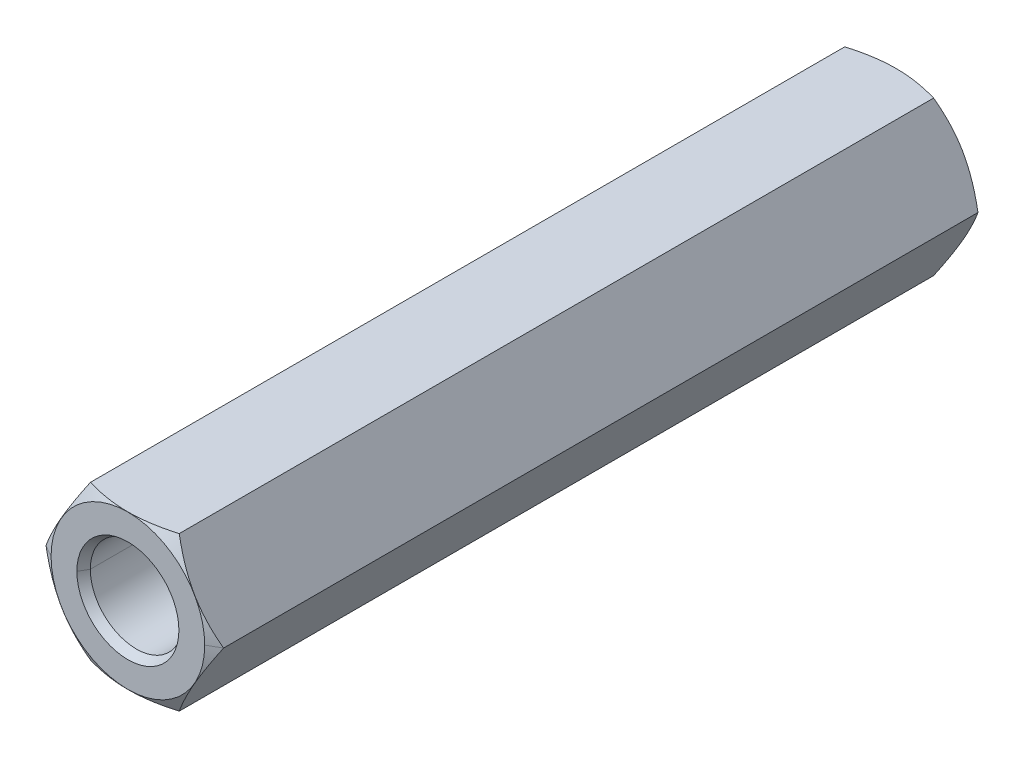
ISO-10303-21;
HEADER;
FILE_DESCRIPTION(('STEP AP214'),'2;1');
FILE_NAME('part.step','',(''),(''),'','','');
FILE_SCHEMA(('AUTOMOTIVE_DESIGN { 1 0 10303 214 1 1 1 1 }'));
ENDSEC;
DATA;
#1=APPLICATION_CONTEXT('core data for automotive mechanical design processes');
#2=APPLICATION_PROTOCOL_DEFINITION('international standard','automotive_design',2000,#1);
#3=PRODUCT_CONTEXT('',#1,'mechanical');
#4=PRODUCT('Part','Part','',(#3));
#5=PRODUCT_RELATED_PRODUCT_CATEGORY('part','',(#4));
#6=PRODUCT_DEFINITION_FORMATION('','',#4);
#7=PRODUCT_DEFINITION_CONTEXT('part definition',#1,'design');
#8=PRODUCT_DEFINITION('design','',#6,#7);
#9=PRODUCT_DEFINITION_SHAPE('','',#8);
#10=(LENGTH_UNIT() NAMED_UNIT(*) SI_UNIT(.MILLI.,.METRE.));
#11=(NAMED_UNIT(*) PLANE_ANGLE_UNIT() SI_UNIT($,.RADIAN.));
#12=(NAMED_UNIT(*) SI_UNIT($,.STERADIAN.) SOLID_ANGLE_UNIT());
#13=UNCERTAINTY_MEASURE_WITH_UNIT(LENGTH_MEASURE(1.E-05),#10,'distance_accuracy_value','');
#14=(GEOMETRIC_REPRESENTATION_CONTEXT(3) GLOBAL_UNCERTAINTY_ASSIGNED_CONTEXT((#13)) GLOBAL_UNIT_ASSIGNED_CONTEXT((#10,
#11,#12)) REPRESENTATION_CONTEXT('',''));
#15=CARTESIAN_POINT('',(0.,0.,0.));
#16=DIRECTION('',(0.,0.,1.));
#17=DIRECTION('',(1.,0.,0.));
#18=AXIS2_PLACEMENT_3D('',#15,#16,#17);
#19=CARTESIAN_POINT('',(116.318744279938,82.8420432923505,150.447608312383));
#20=DIRECTION('',(0.,0.,-1.));
#21=DIRECTION('',(1.,0.,0.));
#22=AXIS2_PLACEMENT_3D('',#19,#20,#21);
#23=CONICAL_SURFACE('',#22,1.73205080757048,1.047197551197);
#24=DIRECTION('',(0.86602540378464,0.,-0.499999999999652));
#25=VECTOR('',#24,1.);
#26=CARTESIAN_POINT('',(118.050795087508,82.8420432923505,150.447608312383));
#27=LINE('',#26,#25);
#28=CARTESIAN_POINT('',(116.318744279938,82.8420432923505,151.447608312383));
#29=VERTEX_POINT('',#28);
#30=CARTESIAN_POINT('',(117.818744279938,82.8420432923505,150.581582908599));
#31=VERTEX_POINT('',#30);
#32=EDGE_CURVE('E67',#29,#31,#27,.T.);
#33=ORIENTED_EDGE('',*,*,#32,.F.);
#34=DIRECTION('',(-0.86602540378464,0.,-0.499999999999652));
#35=VECTOR('',#34,1.);
#36=CARTESIAN_POINT('',(114.586693472367,82.8420432923505,150.447608312383));
#37=LINE('',#36,#35);
#38=CARTESIAN_POINT('',(114.818744279938,82.8420432923505,150.581582908599));
#39=VERTEX_POINT('',#38);
#40=EDGE_CURVE('E11',#29,#39,#37,.T.);
#41=ORIENTED_EDGE('',*,*,#40,.T.);
#42=CARTESIAN_POINT('',(116.318744279938,82.8420432923505,150.581582908599));
#43=DIRECTION('',(0.,0.,1.));
#44=DIRECTION('',(1.,0.,0.));
#45=AXIS2_PLACEMENT_3D('',#42,#43,#44);
#46=CIRCLE('',#45,1.5);
#47=EDGE_CURVE('E55',#31,#39,#46,.T.);
#48=ORIENTED_EDGE('',*,*,#47,.F.);
#49=EDGE_LOOP('',(#33,#41,#48));
#50=FACE_BOUND('',#49,.T.);
#51=ADVANCED_FACE('F44',(#50),#23,.F.);
#52=CARTESIAN_POINT('',(116.318744279938,82.8420432923505,150.581582908599));
#53=DIRECTION('',(0.,0.,-1.));
#54=DIRECTION('',(1.,0.,0.));
#55=AXIS2_PLACEMENT_3D('',#52,#53,#54);
#56=CYLINDRICAL_SURFACE('',#55,1.5);
#57=ORIENTED_EDGE('',*,*,#47,.T.);
#58=DIRECTION('',(0.,0.,-1.));
#59=VECTOR('',#58,1.);
#60=CARTESIAN_POINT('',(114.818744279938,82.8420432923505,150.581582908599));
#61=LINE('',#60,#59);
#62=CARTESIAN_POINT('',(114.818744279938,82.8420432923505,140.858711037809));
#63=VERTEX_POINT('',#62);
#64=EDGE_CURVE('E267',#39,#63,#61,.T.);
#65=ORIENTED_EDGE('',*,*,#64,.T.);
#66=CARTESIAN_POINT('',(116.318744279938,82.8420432923505,140.858711037809));
#67=DIRECTION('',(0.,0.,1.));
#68=DIRECTION('',(1.,0.,0.));
#69=AXIS2_PLACEMENT_3D('',#66,#67,#68);
#70=CIRCLE('',#69,1.5);
#71=CARTESIAN_POINT('',(117.818744279938,82.8420432923505,140.858711037809));
#72=VERTEX_POINT('',#71);
#73=EDGE_CURVE('E263',#72,#63,#70,.T.);
#74=ORIENTED_EDGE('',*,*,#73,.F.);
#75=DIRECTION('',(0.,0.,-1.));
#76=VECTOR('',#75,1.);
#77=CARTESIAN_POINT('',(117.818744279938,82.8420432923505,150.581582908599));
#78=LINE('',#77,#76);
#79=EDGE_CURVE('E240',#31,#72,#78,.T.);
#80=ORIENTED_EDGE('',*,*,#79,.F.);
#81=EDGE_LOOP('',(#57,#65,#74,#80));
#82=FACE_BOUND('',#81,.T.);
#83=ADVANCED_FACE('F488',(#82),#56,.F.);
#84=CARTESIAN_POINT('',(116.318744279938,82.8420432923505,140.858711037809));
#85=DIRECTION('',(0.,0.,-1.));
#86=DIRECTION('',(1.,0.,0.));
#87=AXIS2_PLACEMENT_3D('',#84,#85,#86);
#88=CONICAL_SURFACE('',#87,1.5,0.5235987756);
#89=ORIENTED_EDGE('',*,*,#73,.T.);
#90=DIRECTION('',(-0.500000000001473,0.,-0.866025403783588));
#91=VECTOR('',#90,1.);
#92=CARTESIAN_POINT('',(114.818744279938,82.8420432923505,140.858711037809));
#93=LINE('',#92,#91);
#94=CARTESIAN_POINT('',(114.658744279938,82.8420432923505,140.581582908599));
#95=VERTEX_POINT('',#94);
#96=EDGE_CURVE('E268',#63,#95,#93,.T.);
#97=ORIENTED_EDGE('',*,*,#96,.T.);
#98=CARTESIAN_POINT('',(116.318744279938,82.8420432923505,140.581582908599));
#99=DIRECTION('',(0.,0.,1.));
#100=DIRECTION('',(1.,0.,0.));
#101=AXIS2_PLACEMENT_3D('',#98,#99,#100);
#102=CIRCLE('',#101,1.66);
#103=CARTESIAN_POINT('',(117.978744279938,82.8420432923505,140.581582908599));
#104=VERTEX_POINT('',#103);
#105=EDGE_CURVE('E248',#104,#95,#102,.T.);
#106=ORIENTED_EDGE('',*,*,#105,.F.);
#107=DIRECTION('',(0.500000000001473,0.,-0.866025403783588));
#108=VECTOR('',#107,1.);
#109=CARTESIAN_POINT('',(117.818744279938,82.8420432923505,140.858711037809));
#110=LINE('',#109,#108);
#111=EDGE_CURVE('E250',#72,#104,#110,.T.);
#112=ORIENTED_EDGE('',*,*,#111,.F.);
#113=EDGE_LOOP('',(#89,#97,#106,#112));
#114=FACE_BOUND('',#113,.T.);
#115=ADVANCED_FACE('F505',(#114),#88,.F.);
#116=CARTESIAN_POINT('',(116.318744279938,82.8420432923505,140.581582908599));
#117=DIRECTION('',(0.,0.,1.));
#118=DIRECTION('',(1.,0.,0.));
#119=AXIS2_PLACEMENT_3D('',#116,#117,#118);
#120=CONICAL_SURFACE('',#119,2.5,1.047197551197);
#121=CARTESIAN_POINT('',(116.318744279938,82.8420432923505,140.581582908599));
#122=DIRECTION('',(0.,0.,1.));
#123=DIRECTION('',(1.,0.,0.));
#124=AXIS2_PLACEMENT_3D('',#121,#122,#123);
#125=CIRCLE('',#124,2.5);
#126=CARTESIAN_POINT('',(118.818744279938,82.8420432923505,140.581582908599));
#127=VERTEX_POINT('',#126);
#128=CARTESIAN_POINT('',(113.818744279938,82.8420432923505,140.581582908599));
#129=VERTEX_POINT('',#128);
#130=EDGE_CURVE('E289',#127,#129,#125,.T.);
#131=ORIENTED_EDGE('',*,*,#130,.T.);
#132=DIRECTION('',(-0.86602540378464,0.,0.499999999999652));
#133=VECTOR('',#132,1.);
#134=CARTESIAN_POINT('',(113.818744279938,82.8420432923505,140.581582908599));
#135=LINE('',#134,#133);
#136=CARTESIAN_POINT('',(113.428744279938,82.8420432923504,140.806749513583));
#137=VERTEX_POINT('',#136);
#138=EDGE_CURVE('E293',#129,#137,#135,.T.);
#139=ORIENTED_EDGE('',*,*,#138,.T.);
#140=CARTESIAN_POINT('',(114.873744279938,85.3448567092875,140.806749513583));
#141=CARTESIAN_POINT('',(114.151244279938,84.0934500008193,140.389613944093));
#142=CARTESIAN_POINT('',(113.428744279938,82.8420432923504,140.806749513583));
#143=(BOUNDED_CURVE() B_SPLINE_CURVE(2,(#140,#141,#142),.UNSPECIFIED.,.F.,
.F.) B_SPLINE_CURVE_WITH_KNOTS((3,3),(0.,1.),
.UNSPECIFIED.) CURVE() GEOMETRIC_REPRESENTATION_ITEM() RATIONAL_B_SPLINE_CURVE((1.,
1.15470053837935,1.)) REPRESENTATION_ITEM(''));
#144=CARTESIAN_POINT('',(114.873744279938,85.3448567092875,140.806749513583));
#145=VERTEX_POINT('',#144);
#146=EDGE_CURVE('E315',#145,#137,#143,.T.);
#147=ORIENTED_EDGE('',*,*,#146,.F.);
#148=CARTESIAN_POINT('',(117.763744279938,85.3448567092875,140.806749513583));
#149=CARTESIAN_POINT('',(116.318744279938,85.3448567092874,140.389613944093));
#150=CARTESIAN_POINT('',(114.873744279938,85.3448567092875,140.806749513583));
#151=(BOUNDED_CURVE() B_SPLINE_CURVE(2,(#148,#149,#150),.UNSPECIFIED.,.F.,
.F.) B_SPLINE_CURVE_WITH_KNOTS((3,3),(0.,1.),
.UNSPECIFIED.) CURVE() GEOMETRIC_REPRESENTATION_ITEM() RATIONAL_B_SPLINE_CURVE((1.,
1.15470053837926,1.)) REPRESENTATION_ITEM(''));
#152=CARTESIAN_POINT('',(117.763744279938,85.3448567092875,140.806749513583));
#153=VERTEX_POINT('',#152);
#154=EDGE_CURVE('E276',#153,#145,#151,.T.);
#155=ORIENTED_EDGE('',*,*,#154,.F.);
#156=CARTESIAN_POINT('',(119.208744279938,82.8420432923505,140.806749513583));
#157=CARTESIAN_POINT('',(118.486244279938,84.0934500008188,140.389613944093));
#158=CARTESIAN_POINT('',(117.763744279938,85.3448567092875,140.806749513583));
#159=(BOUNDED_CURVE() B_SPLINE_CURVE(2,(#156,#157,#158),.UNSPECIFIED.,.F.,
.F.) B_SPLINE_CURVE_WITH_KNOTS((3,3),(0.,1.),
.UNSPECIFIED.) CURVE() GEOMETRIC_REPRESENTATION_ITEM() RATIONAL_B_SPLINE_CURVE((1.,
1.15470053837946,1.)) REPRESENTATION_ITEM(''));
#160=CARTESIAN_POINT('',(119.208744279938,82.8420432923505,140.806749513583));
#161=VERTEX_POINT('',#160);
#162=EDGE_CURVE('E306',#161,#153,#159,.T.);
#163=ORIENTED_EDGE('',*,*,#162,.F.);
#164=DIRECTION('',(0.86602540378464,0.,0.499999999999652));
#165=VECTOR('',#164,1.);
#166=CARTESIAN_POINT('',(118.818744279938,82.8420432923505,140.581582908599));
#167=LINE('',#166,#165);
#168=EDGE_CURVE('E329',#127,#161,#167,.T.);
#169=ORIENTED_EDGE('',*,*,#168,.F.);
#170=EDGE_LOOP('',(#131,#139,#147,#155,#163,#169));
#171=FACE_BOUND('',#170,.T.);
#172=ADVANCED_FACE('F422',(#171),#120,.T.);
#173=CARTESIAN_POINT('',(116.318744279938,82.8420432923505,165.356416303615));
#174=DIRECTION('',(0.,0.,-1.));
#175=DIRECTION('',(1.,0.,0.));
#176=AXIS2_PLACEMENT_3D('',#173,#174,#175);
#177=CONICAL_SURFACE('',#176,2.89,1.047197551197);
#178=CARTESIAN_POINT('',(116.318744279938,82.8420432923505,165.581582908599));
#179=DIRECTION('',(0.,0.,1.));
#180=DIRECTION('',(1.,0.,0.));
#181=AXIS2_PLACEMENT_3D('',#178,#179,#180);
#182=CIRCLE('',#181,2.5);
#183=CARTESIAN_POINT('',(113.818744279938,82.8420432923505,165.581582908599));
#184=VERTEX_POINT('',#183);
#185=CARTESIAN_POINT('',(118.818744279938,82.8420432923505,165.581582908599));
#186=VERTEX_POINT('',#185);
#187=EDGE_CURVE('E128',#184,#186,#182,.T.);
#188=ORIENTED_EDGE('',*,*,#187,.F.);
#189=DIRECTION('',(-0.86602540378464,0.,-0.499999999999652));
#190=VECTOR('',#189,1.);
#191=CARTESIAN_POINT('',(113.428744279938,82.8420432923505,165.356416303615));
#192=LINE('',#191,#190);
#193=CARTESIAN_POINT('',(113.428744279938,82.8420432923505,165.356416303615));
#194=VERTEX_POINT('',#193);
#195=EDGE_CURVE('E222',#184,#194,#192,.T.);
#196=ORIENTED_EDGE('',*,*,#195,.T.);
#197=CARTESIAN_POINT('',(114.873744279938,80.3392298754135,165.356416303615));
#198=CARTESIAN_POINT('',(114.151244279938,81.5906365838815,165.773551873104));
#199=CARTESIAN_POINT('',(113.428744279938,82.8420432923505,165.356416303615));
#200=(BOUNDED_CURVE() B_SPLINE_CURVE(2,(#197,#198,#199),.UNSPECIFIED.,.F.,
.F.) B_SPLINE_CURVE_WITH_KNOTS((3,3),(0.,1.),
.UNSPECIFIED.) CURVE() GEOMETRIC_REPRESENTATION_ITEM() RATIONAL_B_SPLINE_CURVE((1.,
1.15470053837936,1.)) REPRESENTATION_ITEM(''));
#201=CARTESIAN_POINT('',(114.873744279938,80.3392298754135,165.356416303615));
#202=VERTEX_POINT('',#201);
#203=EDGE_CURVE('E277',#202,#194,#200,.T.);
#204=ORIENTED_EDGE('',*,*,#203,.F.);
#205=CARTESIAN_POINT('',(117.763744279938,80.3392298754135,165.356416303615));
#206=CARTESIAN_POINT('',(116.318744279938,80.3392298754134,165.773551873104));
#207=CARTESIAN_POINT('',(114.873744279938,80.3392298754135,165.356416303615));
#208=(BOUNDED_CURVE() B_SPLINE_CURVE(2,(#205,#206,#207),.UNSPECIFIED.,.F.,
.F.) B_SPLINE_CURVE_WITH_KNOTS((3,3),(0.,1.),
.UNSPECIFIED.) CURVE() GEOMETRIC_REPRESENTATION_ITEM() RATIONAL_B_SPLINE_CURVE((1.,
1.15470053837925,1.)) REPRESENTATION_ITEM(''));
#209=CARTESIAN_POINT('',(117.763744279938,80.3392298754135,165.356416303615));
#210=VERTEX_POINT('',#209);
#211=EDGE_CURVE('E262',#210,#202,#208,.T.);
#212=ORIENTED_EDGE('',*,*,#211,.F.);
#213=CARTESIAN_POINT('',(119.208744279938,82.8420432923505,165.356416303615));
#214=CARTESIAN_POINT('',(118.486244279938,81.5906365838821,165.773551873105));
#215=CARTESIAN_POINT('',(117.763744279938,80.3392298754135,165.356416303615));
#216=(BOUNDED_CURVE() B_SPLINE_CURVE(2,(#213,#214,#215),.UNSPECIFIED.,.F.,
.F.) B_SPLINE_CURVE_WITH_KNOTS((3,3),(0.,1.),
.UNSPECIFIED.) CURVE() GEOMETRIC_REPRESENTATION_ITEM() RATIONAL_B_SPLINE_CURVE((1.,
1.15470053837944,1.)) REPRESENTATION_ITEM(''));
#217=CARTESIAN_POINT('',(119.208744279938,82.8420432923505,165.356416303615));
#218=VERTEX_POINT('',#217);
#219=EDGE_CURVE('E347',#218,#210,#216,.T.);
#220=ORIENTED_EDGE('',*,*,#219,.F.);
#221=DIRECTION('',(0.86602540378464,0.,-0.499999999999652));
#222=VECTOR('',#221,1.);
#223=CARTESIAN_POINT('',(119.208744279938,82.8420432923505,165.356416303615));
#224=LINE('',#223,#222);
#225=EDGE_CURVE('E383',#186,#218,#224,.T.);
#226=ORIENTED_EDGE('',*,*,#225,.F.);
#227=EDGE_LOOP('',(#188,#196,#204,#212,#220,#226));
#228=FACE_BOUND('',#227,.T.);
#229=ADVANCED_FACE('F471',(#228),#177,.T.);
#230=CARTESIAN_POINT('',(116.318744279938,82.8420432923505,165.581582908599));
#231=DIRECTION('',(0.,0.,1.));
#232=DIRECTION('',(1.,0.,0.));
#233=AXIS2_PLACEMENT_3D('',#230,#231,#232);
#234=CONICAL_SURFACE('',#233,1.65999999999899,0.523598775598);
#235=CARTESIAN_POINT('',(116.318744279938,82.8420432923505,165.304454779388));
#236=DIRECTION('',(0.,0.,1.));
#237=DIRECTION('',(1.,0.,0.));
#238=AXIS2_PLACEMENT_3D('',#235,#236,#237);
#239=CIRCLE('',#238,1.5);
#240=CARTESIAN_POINT('',(114.818744279938,82.8420432923505,165.304454779388));
#241=VERTEX_POINT('',#240);
#242=CARTESIAN_POINT('',(117.818744279938,82.8420432923505,165.304454779388));
#243=VERTEX_POINT('',#242);
#244=EDGE_CURVE('E192',#241,#243,#239,.T.);
#245=ORIENTED_EDGE('',*,*,#244,.F.);
#246=DIRECTION('',(-0.499999999999741,0.,0.866025403784588));
#247=VECTOR('',#246,1.);
#248=CARTESIAN_POINT('',(114.658744279939,82.8420432923505,165.581582908599));
#249=LINE('',#248,#247);
#250=CARTESIAN_POINT('',(114.658744279939,82.8420432923505,165.581582908599));
#251=VERTEX_POINT('',#250);
#252=EDGE_CURVE('E197',#241,#251,#249,.T.);
#253=ORIENTED_EDGE('',*,*,#252,.T.);
#254=CARTESIAN_POINT('',(116.318744279938,82.8420432923505,165.581582908599));
#255=DIRECTION('',(0.,0.,1.));
#256=DIRECTION('',(1.,0.,0.));
#257=AXIS2_PLACEMENT_3D('',#254,#255,#256);
#258=CIRCLE('',#257,1.65999999999899);
#259=CARTESIAN_POINT('',(117.978744279937,82.8420432923505,165.581582908599));
#260=VERTEX_POINT('',#259);
#261=EDGE_CURVE('E216',#251,#260,#258,.T.);
#262=ORIENTED_EDGE('',*,*,#261,.T.);
#263=DIRECTION('',(0.499999999999741,0.,0.866025403784588));
#264=VECTOR('',#263,1.);
#265=CARTESIAN_POINT('',(117.978744279937,82.8420432923505,165.581582908599));
#266=LINE('',#265,#264);
#267=EDGE_CURVE('E199',#243,#260,#266,.T.);
#268=ORIENTED_EDGE('',*,*,#267,.F.);
#269=EDGE_LOOP('',(#245,#253,#262,#268));
#270=FACE_BOUND('',#269,.T.);
#271=ADVANCED_FACE('F194',(#270),#234,.F.);
#272=CARTESIAN_POINT('',(116.318744279938,82.8420432923505,165.304454779388));
#273=DIRECTION('',(0.,0.,-1.));
#274=DIRECTION('',(1.,0.,0.));
#275=AXIS2_PLACEMENT_3D('',#272,#273,#274);
#276=CYLINDRICAL_SURFACE('',#275,1.5);
#277=CARTESIAN_POINT('',(116.318744279938,82.8420432923505,165.304454779388));
#278=DIRECTION('',(0.,0.,1.));
#279=DIRECTION('',(1.,0.,0.));
#280=AXIS2_PLACEMENT_3D('',#277,#278,#279);
#281=CIRCLE('',#280,1.5);
#282=EDGE_CURVE('E210',#243,#241,#281,.T.);
#283=ORIENTED_EDGE('',*,*,#282,.T.);
#284=DIRECTION('',(0.,0.,-1.));
#285=VECTOR('',#284,1.);
#286=CARTESIAN_POINT('',(114.818744279938,82.8420432923505,165.304454779388));
#287=LINE('',#286,#285);
#288=CARTESIAN_POINT('',(114.818744279938,82.8420432923505,155.581582908599));
#289=VERTEX_POINT('',#288);
#290=EDGE_CURVE('E212',#241,#289,#287,.T.);
#291=ORIENTED_EDGE('',*,*,#290,.T.);
#292=CARTESIAN_POINT('',(116.318744279938,82.8420432923505,155.581582908599));
#293=DIRECTION('',(0.,0.,1.));
#294=DIRECTION('',(1.,0.,0.));
#295=AXIS2_PLACEMENT_3D('',#292,#293,#294);
#296=CIRCLE('',#295,1.5);
#297=CARTESIAN_POINT('',(117.818744279938,82.8420432923505,155.581582908599));
#298=VERTEX_POINT('',#297);
#299=EDGE_CURVE('E204',#298,#289,#296,.T.);
#300=ORIENTED_EDGE('',*,*,#299,.F.);
#301=DIRECTION('',(0.,0.,-1.));
#302=VECTOR('',#301,1.);
#303=CARTESIAN_POINT('',(117.818744279938,82.8420432923505,165.304454779388));
#304=LINE('',#303,#302);
#305=EDGE_CURVE('E205',#243,#298,#304,.T.);
#306=ORIENTED_EDGE('',*,*,#305,.F.);
#307=EDGE_LOOP('',(#283,#291,#300,#306));
#308=FACE_BOUND('',#307,.T.);
#309=ADVANCED_FACE('F46',(#308),#276,.F.);
#310=CARTESIAN_POINT('',(116.318744279938,82.8420432923505,155.581582908599));
#311=DIRECTION('',(0.,0.,1.));
#312=DIRECTION('',(1.,0.,0.));
#313=AXIS2_PLACEMENT_3D('',#310,#311,#312);
#314=CONICAL_SURFACE('',#313,1.5,1.047197551197);
#315=DIRECTION('',(0.86602540378464,0.,0.499999999999652));
#316=VECTOR('',#315,1.);
#317=CARTESIAN_POINT('',(117.818744279938,82.8420432923505,155.581582908599));
#318=LINE('',#317,#316);
#319=CARTESIAN_POINT('',(116.318744279938,82.8420432923505,154.715557504813));
#320=VERTEX_POINT('',#319);
#321=EDGE_CURVE('E253',#320,#298,#318,.T.);
#322=ORIENTED_EDGE('',*,*,#321,.F.);
#323=DIRECTION('',(-0.86602540378464,0.,0.499999999999652));
#324=VECTOR('',#323,1.);
#325=CARTESIAN_POINT('',(114.818744279938,82.8420432923505,155.581582908599));
#326=LINE('',#325,#324);
#327=EDGE_CURVE('E48',#320,#289,#326,.T.);
#328=ORIENTED_EDGE('',*,*,#327,.T.);
#329=CARTESIAN_POINT('',(116.318744279938,82.8420432923505,155.581582908599));
#330=DIRECTION('',(0.,0.,1.));
#331=DIRECTION('',(1.,0.,0.));
#332=AXIS2_PLACEMENT_3D('',#329,#330,#331);
#333=CIRCLE('',#332,1.5);
#334=EDGE_CURVE('E226',#289,#298,#333,.T.);
#335=ORIENTED_EDGE('',*,*,#334,.T.);
#336=EDGE_LOOP('',(#322,#328,#335));
#337=FACE_BOUND('',#336,.T.);
#338=ADVANCED_FACE('F410',(#337),#314,.F.);
#339=CARTESIAN_POINT('',(116.318744279938,82.8420432923505,155.581582908599));
#340=DIRECTION('',(0.,0.,1.));
#341=DIRECTION('',(1.,0.,0.));
#342=AXIS2_PLACEMENT_3D('',#339,#340,#341);
#343=CONICAL_SURFACE('',#342,1.5,1.047197551197);
#344=ORIENTED_EDGE('',*,*,#327,.F.);
#345=ORIENTED_EDGE('',*,*,#321,.T.);
#346=ORIENTED_EDGE('',*,*,#299,.T.);
#347=EDGE_LOOP('',(#344,#345,#346));
#348=FACE_BOUND('',#347,.T.);
#349=ADVANCED_FACE('F408',(#348),#343,.F.);
#350=CARTESIAN_POINT('',(116.318744279938,82.8420432923505,165.304454779388));
#351=DIRECTION('',(0.,0.,-1.));
#352=DIRECTION('',(1.,0.,0.));
#353=AXIS2_PLACEMENT_3D('',#350,#351,#352);
#354=CYLINDRICAL_SURFACE('',#353,1.5);
#355=ORIENTED_EDGE('',*,*,#290,.F.);
#356=ORIENTED_EDGE('',*,*,#244,.T.);
#357=ORIENTED_EDGE('',*,*,#305,.T.);
#358=ORIENTED_EDGE('',*,*,#334,.F.);
#359=EDGE_LOOP('',(#355,#356,#357,#358));
#360=FACE_BOUND('',#359,.T.);
#361=ADVANCED_FACE('F224',(#360),#354,.F.);
#362=CARTESIAN_POINT('',(116.318744279938,82.8420432923505,165.581582908599));
#363=DIRECTION('',(0.,0.,1.));
#364=DIRECTION('',(1.,0.,0.));
#365=AXIS2_PLACEMENT_3D('',#362,#363,#364);
#366=CONICAL_SURFACE('',#365,1.65999999999899,0.523598775598);
#367=ORIENTED_EDGE('',*,*,#252,.F.);
#368=ORIENTED_EDGE('',*,*,#282,.F.);
#369=ORIENTED_EDGE('',*,*,#267,.T.);
#370=CARTESIAN_POINT('',(116.318744279938,82.8420432923505,165.581582908599));
#371=DIRECTION('',(0.,0.,1.));
#372=DIRECTION('',(1.,0.,0.));
#373=AXIS2_PLACEMENT_3D('',#370,#371,#372);
#374=CIRCLE('',#373,1.65999999999899);
#375=EDGE_CURVE('E220',#260,#251,#374,.T.);
#376=ORIENTED_EDGE('',*,*,#375,.T.);
#377=EDGE_LOOP('',(#367,#368,#369,#376));
#378=FACE_BOUND('',#377,.T.);
#379=ADVANCED_FACE('F218',(#378),#366,.F.);
#380=CARTESIAN_POINT('',(116.318744279938,82.8420432923505,165.581582908599));
#381=DIRECTION('',(0.,0.,1.));
#382=DIRECTION('',(1.,0.,0.));
#383=AXIS2_PLACEMENT_3D('',#380,#381,#382);
#384=PLANE('',#383);
#385=CARTESIAN_POINT('',(116.318744279938,82.8420432923505,165.581582908599));
#386=DIRECTION('',(0.,0.,1.));
#387=DIRECTION('',(1.,0.,0.));
#388=AXIS2_PLACEMENT_3D('',#385,#386,#387);
#389=CIRCLE('',#388,2.5);
#390=EDGE_CURVE('E389',#186,#184,#389,.T.);
#391=ORIENTED_EDGE('',*,*,#390,.T.);
#392=ORIENTED_EDGE('',*,*,#187,.T.);
#393=EDGE_LOOP('',(#391,#392));
#394=FACE_BOUND('',#393,.T.);
#395=ORIENTED_EDGE('',*,*,#375,.F.);
#396=ORIENTED_EDGE('',*,*,#261,.F.);
#397=EDGE_LOOP('',(#395,#396));
#398=FACE_BOUND('',#397,.T.);
#399=ADVANCED_FACE('F475',(#394,#398),#384,.T.);
#400=CARTESIAN_POINT('',(116.318744279938,82.8420432923505,165.356416303615));
#401=DIRECTION('',(0.,0.,-1.));
#402=DIRECTION('',(1.,0.,0.));
#403=AXIS2_PLACEMENT_3D('',#400,#401,#402);
#404=CONICAL_SURFACE('',#403,2.89,1.047197551197);
#405=ORIENTED_EDGE('',*,*,#195,.F.);
#406=ORIENTED_EDGE('',*,*,#390,.F.);
#407=ORIENTED_EDGE('',*,*,#225,.T.);
#408=CARTESIAN_POINT('',(117.763744279938,85.3448567092875,165.356416303615));
#409=CARTESIAN_POINT('',(118.486244279938,84.0934500008193,165.773551873104));
#410=CARTESIAN_POINT('',(119.208744279938,82.8420432923505,165.356416303615));
#411=(BOUNDED_CURVE() B_SPLINE_CURVE(2,(#408,#409,#410),.UNSPECIFIED.,.F.,
.F.) B_SPLINE_CURVE_WITH_KNOTS((3,3),(0.,1.),
.UNSPECIFIED.) CURVE() GEOMETRIC_REPRESENTATION_ITEM() RATIONAL_B_SPLINE_CURVE((1.,
1.15470053837935,1.)) REPRESENTATION_ITEM(''));
#412=CARTESIAN_POINT('',(117.763744279938,85.3448567092875,165.356416303615));
#413=VERTEX_POINT('',#412);
#414=EDGE_CURVE('E300',#413,#218,#411,.T.);
#415=ORIENTED_EDGE('',*,*,#414,.F.);
#416=CARTESIAN_POINT('',(114.873744279938,85.3448567092875,165.356416303615));
#417=CARTESIAN_POINT('',(116.318744279938,85.3448567092874,165.773551873104));
#418=CARTESIAN_POINT('',(117.763744279938,85.3448567092875,165.356416303615));
#419=(BOUNDED_CURVE() B_SPLINE_CURVE(2,(#416,#417,#418),.UNSPECIFIED.,.F.,
.F.) B_SPLINE_CURVE_WITH_KNOTS((3,3),(0.,1.),
.UNSPECIFIED.) CURVE() GEOMETRIC_REPRESENTATION_ITEM() RATIONAL_B_SPLINE_CURVE((1.,
1.15470053837925,1.)) REPRESENTATION_ITEM(''));
#420=CARTESIAN_POINT('',(114.873744279938,85.3448567092875,165.356416303615));
#421=VERTEX_POINT('',#420);
#422=EDGE_CURVE('E269',#421,#413,#419,.T.);
#423=ORIENTED_EDGE('',*,*,#422,.F.);
#424=CARTESIAN_POINT('',(113.428744279938,82.8420432923505,165.356416303615));
#425=CARTESIAN_POINT('',(114.151244279937,84.0934500008188,165.773551873104));
#426=CARTESIAN_POINT('',(114.873744279938,85.3448567092875,165.356416303615));
#427=(BOUNDED_CURVE() B_SPLINE_CURVE(2,(#424,#425,#426),.UNSPECIFIED.,.F.,
.F.) B_SPLINE_CURVE_WITH_KNOTS((3,3),(0.,1.),
.UNSPECIFIED.) CURVE() GEOMETRIC_REPRESENTATION_ITEM() RATIONAL_B_SPLINE_CURVE((1.,
1.15470053837944,1.)) REPRESENTATION_ITEM(''));
#428=EDGE_CURVE('E115',#194,#421,#427,.T.);
#429=ORIENTED_EDGE('',*,*,#428,.F.);
#430=EDGE_LOOP('',(#405,#406,#407,#415,#423,#429));
#431=FACE_BOUND('',#430,.T.);
#432=ADVANCED_FACE('F473',(#431),#404,.T.);
#433=CARTESIAN_POINT('',(117.763744279938,80.3392298754135,140.581582908599));
#434=DIRECTION('',(-0.866025403784329,0.50000000000019,0.));
#435=DIRECTION('',(0.,0.,1.));
#436=AXIS2_PLACEMENT_3D('',#433,#434,#435);
#437=PLANE('',#436);
#438=DIRECTION('',(0.,0.,1.));
#439=VECTOR('',#438,1.);
#440=CARTESIAN_POINT('',(119.208744279938,82.8420432923505,140.806749513583));
#441=LINE('',#440,#439);
#442=EDGE_CURVE('E356',#161,#218,#441,.T.);
#443=ORIENTED_EDGE('',*,*,#442,.T.);
#444=ORIENTED_EDGE('',*,*,#219,.T.);
#445=DIRECTION('',(0.,0.,1.));
#446=VECTOR('',#445,1.);
#447=CARTESIAN_POINT('',(117.763744279938,80.3392298754135,140.581582908599));
#448=LINE('',#447,#446);
#449=CARTESIAN_POINT('',(117.763744279938,80.3392298754135,140.806749513583));
#450=VERTEX_POINT('',#449);
#451=EDGE_CURVE('E257',#450,#210,#448,.T.);
#452=ORIENTED_EDGE('',*,*,#451,.F.);
#453=CARTESIAN_POINT('',(117.763744279938,80.3392298754135,140.806749513583));
#454=CARTESIAN_POINT('',(118.486244279938,81.5906365838816,140.389613944093));
#455=CARTESIAN_POINT('',(119.208744279938,82.8420432923505,140.806749513583));
#456=(BOUNDED_CURVE() B_SPLINE_CURVE(2,(#453,#454,#455),.UNSPECIFIED.,.F.,
.F.) B_SPLINE_CURVE_WITH_KNOTS((3,3),(0.,1.),
.UNSPECIFIED.) CURVE() GEOMETRIC_REPRESENTATION_ITEM() RATIONAL_B_SPLINE_CURVE((1.,
1.15470053837935,1.)) REPRESENTATION_ITEM(''));
#457=EDGE_CURVE('E261',#450,#161,#456,.T.);
#458=ORIENTED_EDGE('',*,*,#457,.T.);
#459=EDGE_LOOP('',(#443,#444,#452,#458));
#460=FACE_BOUND('',#459,.T.);
#461=ADVANCED_FACE('F449',(#460),#437,.F.);
#462=CARTESIAN_POINT('',(114.873744279938,80.3392298754135,140.581582908599));
#463=DIRECTION('',(0.,1.,0.));
#464=DIRECTION('',(1.,0.,0.));
#465=AXIS2_PLACEMENT_3D('',#462,#463,#464);
#466=PLANE('',#465);
#467=ORIENTED_EDGE('',*,*,#451,.T.);
#468=ORIENTED_EDGE('',*,*,#211,.T.);
#469=DIRECTION('',(0.,0.,1.));
#470=VECTOR('',#469,1.);
#471=CARTESIAN_POINT('',(114.873744279938,80.3392298754135,140.581582908599));
#472=LINE('',#471,#470);
#473=CARTESIAN_POINT('',(114.873744279938,80.3392298754135,140.806749513583));
#474=VERTEX_POINT('',#473);
#475=EDGE_CURVE('E284',#474,#202,#472,.T.);
#476=ORIENTED_EDGE('',*,*,#475,.F.);
#477=CARTESIAN_POINT('',(114.873744279938,80.3392298754135,140.806749513583));
#478=CARTESIAN_POINT('',(116.318744279938,80.3392298754134,140.389613944093));
#479=CARTESIAN_POINT('',(117.763744279938,80.3392298754135,140.806749513583));
#480=(BOUNDED_CURVE() B_SPLINE_CURVE(2,(#477,#478,#479),.UNSPECIFIED.,.F.,
.F.) B_SPLINE_CURVE_WITH_KNOTS((3,3),(0.,1.),
.UNSPECIFIED.) CURVE() GEOMETRIC_REPRESENTATION_ITEM() RATIONAL_B_SPLINE_CURVE((1.,
1.15470053837926,1.)) REPRESENTATION_ITEM(''));
#481=EDGE_CURVE('E346',#474,#450,#480,.T.);
#482=ORIENTED_EDGE('',*,*,#481,.T.);
#483=EDGE_LOOP('',(#467,#468,#476,#482));
#484=FACE_BOUND('',#483,.T.);
#485=ADVANCED_FACE('F470',(#484),#466,.F.);
#486=CARTESIAN_POINT('',(113.428744279938,82.8420432923505,140.581582908599));
#487=DIRECTION('',(0.866025403784329,0.50000000000019,0.));
#488=DIRECTION('',(0.,0.,-1.));
#489=AXIS2_PLACEMENT_3D('',#486,#487,#488);
#490=PLANE('',#489);
#491=ORIENTED_EDGE('',*,*,#475,.T.);
#492=ORIENTED_EDGE('',*,*,#203,.T.);
#493=DIRECTION('',(0.,0.,1.));
#494=VECTOR('',#493,1.);
#495=CARTESIAN_POINT('',(113.428744279938,82.8420432923505,140.581582908599));
#496=LINE('',#495,#494);
#497=EDGE_CURVE('E314',#137,#194,#496,.T.);
#498=ORIENTED_EDGE('',*,*,#497,.F.);
#499=CARTESIAN_POINT('',(113.428744279938,82.8420432923504,140.806749513583));
#500=CARTESIAN_POINT('',(114.151244279937,81.590636583882,140.389613944093));
#501=CARTESIAN_POINT('',(114.873744279938,80.3392298754135,140.806749513583));
#502=(BOUNDED_CURVE() B_SPLINE_CURVE(2,(#499,#500,#501),.UNSPECIFIED.,.F.,
.F.) B_SPLINE_CURVE_WITH_KNOTS((3,3),(0.,1.),
.UNSPECIFIED.) CURVE() GEOMETRIC_REPRESENTATION_ITEM() RATIONAL_B_SPLINE_CURVE((1.,
1.15470053837945,1.)) REPRESENTATION_ITEM(''));
#503=EDGE_CURVE('E236',#137,#474,#502,.T.);
#504=ORIENTED_EDGE('',*,*,#503,.T.);
#505=EDGE_LOOP('',(#491,#492,#498,#504));
#506=FACE_BOUND('',#505,.T.);
#507=ADVANCED_FACE('F436',(#506),#490,.F.);
#508=CARTESIAN_POINT('',(114.873744279938,85.3448567092875,140.581582908599));
#509=DIRECTION('',(0.866025403784329,-0.50000000000019,0.));
#510=DIRECTION('',(0.,0.,-1.));
#511=AXIS2_PLACEMENT_3D('',#508,#509,#510);
#512=PLANE('',#511);
#513=ORIENTED_EDGE('',*,*,#497,.T.);
#514=ORIENTED_EDGE('',*,*,#428,.T.);
#515=DIRECTION('',(0.,0.,1.));
#516=VECTOR('',#515,1.);
#517=CARTESIAN_POINT('',(114.873744279938,85.3448567092875,140.581582908599));
#518=LINE('',#517,#516);
#519=EDGE_CURVE('E275',#145,#421,#518,.T.);
#520=ORIENTED_EDGE('',*,*,#519,.F.);
#521=ORIENTED_EDGE('',*,*,#146,.T.);
#522=EDGE_LOOP('',(#513,#514,#520,#521));
#523=FACE_BOUND('',#522,.T.);
#524=ADVANCED_FACE('F438',(#523),#512,.F.);
#525=CARTESIAN_POINT('',(117.763744279938,85.3448567092875,140.581582908599));
#526=DIRECTION('',(0.,-1.,0.));
#527=DIRECTION('',(-1.,0.,0.));
#528=AXIS2_PLACEMENT_3D('',#525,#526,#527);
#529=PLANE('',#528);
#530=ORIENTED_EDGE('',*,*,#519,.T.);
#531=ORIENTED_EDGE('',*,*,#422,.T.);
#532=DIRECTION('',(0.,0.,1.));
#533=VECTOR('',#532,1.);
#534=CARTESIAN_POINT('',(117.763744279938,85.3448567092875,140.581582908599));
#535=LINE('',#534,#533);
#536=EDGE_CURVE('E305',#153,#413,#535,.T.);
#537=ORIENTED_EDGE('',*,*,#536,.F.);
#538=ORIENTED_EDGE('',*,*,#154,.T.);
#539=EDGE_LOOP('',(#530,#531,#537,#538));
#540=FACE_BOUND('',#539,.T.);
#541=ADVANCED_FACE('F440',(#540),#529,.F.);
#542=CARTESIAN_POINT('',(119.208744279938,82.8420432923505,140.581582908599));
#543=DIRECTION('',(-0.866025403784329,-0.50000000000019,0.));
#544=DIRECTION('',(-0.50000000000019,0.866025403784329,0.));
#545=AXIS2_PLACEMENT_3D('',#542,#543,#544);
#546=PLANE('',#545);
#547=ORIENTED_EDGE('',*,*,#536,.T.);
#548=ORIENTED_EDGE('',*,*,#414,.T.);
#549=ORIENTED_EDGE('',*,*,#442,.F.);
#550=ORIENTED_EDGE('',*,*,#162,.T.);
#551=EDGE_LOOP('',(#547,#548,#549,#550));
#552=FACE_BOUND('',#551,.T.);
#553=ADVANCED_FACE('F446',(#552),#546,.F.);
#554=CARTESIAN_POINT('',(116.318744279938,82.8420432923505,140.581582908599));
#555=DIRECTION('',(0.,0.,1.));
#556=DIRECTION('',(1.,0.,0.));
#557=AXIS2_PLACEMENT_3D('',#554,#555,#556);
#558=CONICAL_SURFACE('',#557,2.5,1.047197551197);
#559=ORIENTED_EDGE('',*,*,#138,.F.);
#560=CARTESIAN_POINT('',(116.318744279938,82.8420432923505,140.581582908599));
#561=DIRECTION('',(0.,0.,1.));
#562=DIRECTION('',(1.,0.,0.));
#563=AXIS2_PLACEMENT_3D('',#560,#561,#562);
#564=CIRCLE('',#563,2.5);
#565=EDGE_CURVE('E332',#129,#127,#564,.T.);
#566=ORIENTED_EDGE('',*,*,#565,.T.);
#567=ORIENTED_EDGE('',*,*,#168,.T.);
#568=ORIENTED_EDGE('',*,*,#457,.F.);
#569=ORIENTED_EDGE('',*,*,#481,.F.);
#570=ORIENTED_EDGE('',*,*,#503,.F.);
#571=EDGE_LOOP('',(#559,#566,#567,#568,#569,#570));
#572=FACE_BOUND('',#571,.T.);
#573=ADVANCED_FACE('F430',(#572),#558,.T.);
#574=CARTESIAN_POINT('',(116.318744279938,82.8420432923505,140.581582908599));
#575=DIRECTION('',(0.,0.,1.));
#576=DIRECTION('',(1.,0.,0.));
#577=AXIS2_PLACEMENT_3D('',#574,#575,#576);
#578=PLANE('',#577);
#579=ORIENTED_EDGE('',*,*,#130,.F.);
#580=ORIENTED_EDGE('',*,*,#565,.F.);
#581=EDGE_LOOP('',(#579,#580));
#582=FACE_BOUND('',#581,.T.);
#583=ORIENTED_EDGE('',*,*,#105,.T.);
#584=CARTESIAN_POINT('',(116.318744279938,82.8420432923505,140.581582908599));
#585=DIRECTION('',(0.,0.,1.));
#586=DIRECTION('',(1.,0.,0.));
#587=AXIS2_PLACEMENT_3D('',#584,#585,#586);
#588=CIRCLE('',#587,1.66);
#589=EDGE_CURVE('E244',#95,#104,#588,.T.);
#590=ORIENTED_EDGE('',*,*,#589,.T.);
#591=EDGE_LOOP('',(#583,#590));
#592=FACE_BOUND('',#591,.T.);
#593=ADVANCED_FACE('F507',(#582,#592),#578,.F.);
#594=CARTESIAN_POINT('',(116.318744279938,82.8420432923505,140.858711037809));
#595=DIRECTION('',(0.,0.,-1.));
#596=DIRECTION('',(1.,0.,0.));
#597=AXIS2_PLACEMENT_3D('',#594,#595,#596);
#598=CONICAL_SURFACE('',#597,1.5,0.5235987756);
#599=ORIENTED_EDGE('',*,*,#96,.F.);
#600=CARTESIAN_POINT('',(116.318744279938,82.8420432923505,140.858711037809));
#601=DIRECTION('',(0.,0.,1.));
#602=DIRECTION('',(1.,0.,0.));
#603=AXIS2_PLACEMENT_3D('',#600,#601,#602);
#604=CIRCLE('',#603,1.5);
#605=EDGE_CURVE('E249',#63,#72,#604,.T.);
#606=ORIENTED_EDGE('',*,*,#605,.T.);
#607=ORIENTED_EDGE('',*,*,#111,.T.);
#608=ORIENTED_EDGE('',*,*,#589,.F.);
#609=EDGE_LOOP('',(#599,#606,#607,#608));
#610=FACE_BOUND('',#609,.T.);
#611=ADVANCED_FACE('F498',(#610),#598,.F.);
#612=CARTESIAN_POINT('',(116.318744279938,82.8420432923505,150.581582908599));
#613=DIRECTION('',(0.,0.,-1.));
#614=DIRECTION('',(1.,0.,0.));
#615=AXIS2_PLACEMENT_3D('',#612,#613,#614);
#616=CYLINDRICAL_SURFACE('',#615,1.5);
#617=ORIENTED_EDGE('',*,*,#64,.F.);
#618=CARTESIAN_POINT('',(116.318744279938,82.8420432923505,150.581582908599));
#619=DIRECTION('',(0.,0.,1.));
#620=DIRECTION('',(1.,0.,0.));
#621=AXIS2_PLACEMENT_3D('',#618,#619,#620);
#622=CIRCLE('',#621,1.5);
#623=EDGE_CURVE('E242',#39,#31,#622,.T.);
#624=ORIENTED_EDGE('',*,*,#623,.T.);
#625=ORIENTED_EDGE('',*,*,#79,.T.);
#626=ORIENTED_EDGE('',*,*,#605,.F.);
#627=EDGE_LOOP('',(#617,#624,#625,#626));
#628=FACE_BOUND('',#627,.T.);
#629=ADVANCED_FACE('F495',(#628),#616,.F.);
#630=CARTESIAN_POINT('',(116.318744279938,82.8420432923505,150.447608312383));
#631=DIRECTION('',(0.,0.,-1.));
#632=DIRECTION('',(1.,0.,0.));
#633=AXIS2_PLACEMENT_3D('',#630,#631,#632);
#634=CONICAL_SURFACE('',#633,1.73205080757048,1.047197551197);
#635=ORIENTED_EDGE('',*,*,#40,.F.);
#636=ORIENTED_EDGE('',*,*,#32,.T.);
#637=ORIENTED_EDGE('',*,*,#623,.F.);
#638=EDGE_LOOP('',(#635,#636,#637));
#639=FACE_BOUND('',#638,.T.);
#640=ADVANCED_FACE('F493',(#639),#634,.F.);
#641=CLOSED_SHELL('',(#51,#83,#115,#172,#229,#271,#309,#338,#349,#361,#379,#399,#432,#461,#485,
#507,#524,#541,#553,#573,#593,#611,#629,#640));
#642=MANIFOLD_SOLID_BREP('B2',#641);
#643=ADVANCED_BREP_SHAPE_REPRESENTATION('',(#18,#642),#14);
#644=SHAPE_DEFINITION_REPRESENTATION(#9,#643);
ENDSEC;
END-ISO-10303-21;
